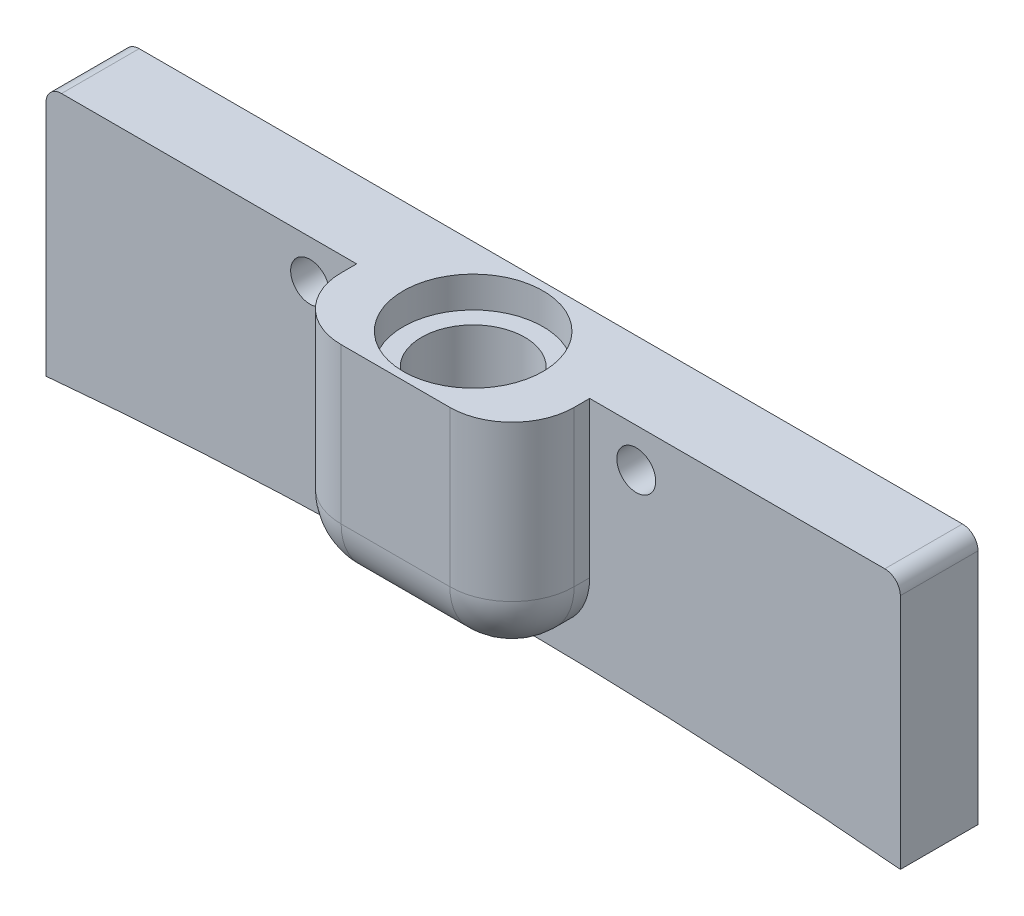
ISO-10303-21;
HEADER;
FILE_DESCRIPTION(('STEP AP214'),'2;1');
FILE_NAME('part.step','',(''),(''),'','','');
FILE_SCHEMA(('AUTOMOTIVE_DESIGN { 1 0 10303 214 1 1 1 1 }'));
ENDSEC;
DATA;
#1=APPLICATION_CONTEXT('core data for automotive mechanical design processes');
#2=APPLICATION_PROTOCOL_DEFINITION('international standard','automotive_design',2000,#1);
#3=PRODUCT_CONTEXT('',#1,'mechanical');
#4=PRODUCT('Part','Part','',(#3));
#5=PRODUCT_RELATED_PRODUCT_CATEGORY('part','',(#4));
#6=PRODUCT_DEFINITION_FORMATION('','',#4);
#7=PRODUCT_DEFINITION_CONTEXT('part definition',#1,'design');
#8=PRODUCT_DEFINITION('design','',#6,#7);
#9=PRODUCT_DEFINITION_SHAPE('','',#8);
#10=(LENGTH_UNIT() NAMED_UNIT(*) SI_UNIT(.MILLI.,.METRE.));
#11=(NAMED_UNIT(*) PLANE_ANGLE_UNIT() SI_UNIT($,.RADIAN.));
#12=(NAMED_UNIT(*) SI_UNIT($,.STERADIAN.) SOLID_ANGLE_UNIT());
#13=UNCERTAINTY_MEASURE_WITH_UNIT(LENGTH_MEASURE(1.E-05),#10,'distance_accuracy_value','');
#14=(GEOMETRIC_REPRESENTATION_CONTEXT(3) GLOBAL_UNCERTAINTY_ASSIGNED_CONTEXT((#13)) GLOBAL_UNIT_ASSIGNED_CONTEXT((#10,
#11,#12)) REPRESENTATION_CONTEXT('',''));
#15=CARTESIAN_POINT('',(0.,0.,0.));
#16=DIRECTION('',(0.,0.,1.));
#17=DIRECTION('',(1.,0.,0.));
#18=AXIS2_PLACEMENT_3D('',#15,#16,#17);
#19=CARTESIAN_POINT('',(-1.09287578986539E-12,-315.000000000012,5.));
#20=DIRECTION('',(0.,0.,-1.));
#21=DIRECTION('',(-1.,0.,0.));
#22=AXIS2_PLACEMENT_3D('',#19,#20,#21);
#23=CYLINDRICAL_SURFACE('',#22,299.999999999988);
#24=CARTESIAN_POINT('',(-1.09287578986539E-12,-315.000000000012,0.));
#25=DIRECTION('',(0.,0.,1.));
#26=DIRECTION('',(1.,0.,0.));
#27=AXIS2_PLACEMENT_3D('',#24,#25,#26);
#28=CIRCLE('',#27,299.999999999988);
#29=CARTESIAN_POINT('',(27.5,-16.263075599976,0.));
#30=VERTEX_POINT('',#29);
#31=CARTESIAN_POINT('',(-27.5000000737673,-16.2630756067663,0.));
#32=VERTEX_POINT('',#31);
#33=EDGE_CURVE('E212',#30,#32,#28,.T.);
#34=ORIENTED_EDGE('',*,*,#33,.F.);
#35=DIRECTION('',(0.,0.,-1.));
#36=VECTOR('',#35,1.);
#37=CARTESIAN_POINT('',(27.5,-16.263075599976,5.));
#38=LINE('',#37,#36);
#39=CARTESIAN_POINT('',(27.5,-16.263075599976,5.));
#40=VERTEX_POINT('',#39);
#41=EDGE_CURVE('E202',#40,#30,#38,.T.);
#42=ORIENTED_EDGE('',*,*,#41,.F.);
#43=CARTESIAN_POINT('',(-1.09287578986539E-12,-315.000000000012,5.));
#44=DIRECTION('',(0.,0.,1.));
#45=DIRECTION('',(1.,0.,0.));
#46=AXIS2_PLACEMENT_3D('',#43,#44,#45);
#47=CIRCLE('',#46,299.999999999988);
#48=CARTESIAN_POINT('',(-27.5000000737673,-16.2630756067663,5.));
#49=VERTEX_POINT('',#48);
#50=EDGE_CURVE('E165',#40,#49,#47,.T.);
#51=ORIENTED_EDGE('',*,*,#50,.T.);
#52=DIRECTION('',(0.,0.,-1.));
#53=VECTOR('',#52,1.);
#54=CARTESIAN_POINT('',(-27.5000000737673,-16.2630756067663,5.));
#55=LINE('',#54,#53);
#56=EDGE_CURVE('E199',#49,#32,#55,.T.);
#57=ORIENTED_EDGE('',*,*,#56,.T.);
#58=EDGE_LOOP('',(#34,#42,#51,#57));
#59=FACE_BOUND('',#58,.T.);
#60=ADVANCED_FACE('F32',(#59),#23,.F.);
#61=CARTESIAN_POINT('',(27.5,0.,5.));
#62=DIRECTION('',(1.,0.,0.));
#63=DIRECTION('',(0.,0.,-1.));
#64=AXIS2_PLACEMENT_3D('',#61,#62,#63);
#65=PLANE('',#64);
#66=DIRECTION('',(0.,-1.,0.));
#67=VECTOR('',#66,1.);
#68=CARTESIAN_POINT('',(27.5,0.,0.));
#69=LINE('',#68,#67);
#70=CARTESIAN_POINT('',(27.5,-1.,0.));
#71=VERTEX_POINT('',#70);
#72=EDGE_CURVE('E205',#71,#30,#69,.T.);
#73=ORIENTED_EDGE('',*,*,#72,.F.);
#74=DIRECTION('',(0.,0.,-1.));
#75=VECTOR('',#74,1.);
#76=CARTESIAN_POINT('',(27.5,-1.,5.));
#77=LINE('',#76,#75);
#78=CARTESIAN_POINT('',(27.5,-1.,5.));
#79=VERTEX_POINT('',#78);
#80=EDGE_CURVE('E290',#71,#79,#77,.F.);
#81=ORIENTED_EDGE('',*,*,#80,.T.);
#82=DIRECTION('',(0.,-1.,0.));
#83=VECTOR('',#82,1.);
#84=CARTESIAN_POINT('',(27.5,0.,5.));
#85=LINE('',#84,#83);
#86=EDGE_CURVE('E187',#79,#40,#85,.T.);
#87=ORIENTED_EDGE('',*,*,#86,.T.);
#88=ORIENTED_EDGE('',*,*,#41,.T.);
#89=EDGE_LOOP('',(#73,#81,#87,#88));
#90=FACE_BOUND('',#89,.T.);
#91=ADVANCED_FACE('F315',(#90),#65,.T.);
#92=CARTESIAN_POINT('',(-27.5000000737673,0.,5.));
#93=DIRECTION('',(0.,1.,0.));
#94=DIRECTION('',(-1.,0.,0.));
#95=AXIS2_PLACEMENT_3D('',#92,#93,#94);
#96=PLANE('',#95);
#97=CARTESIAN_POINT('',(0.,0.,5.));
#98=DIRECTION('',(0.,1.,0.));
#99=DIRECTION('',(0.,0.,1.));
#100=AXIS2_PLACEMENT_3D('',#97,#98,#99);
#101=CIRCLE('',#100,4.49999999999999);
#102=CARTESIAN_POINT('',(0.,0.,9.49999999999999));
#103=VERTEX_POINT('',#102);
#104=EDGE_CURVE('E248',#103,#103,#101,.T.);
#105=ORIENTED_EDGE('',*,*,#104,.F.);
#106=EDGE_LOOP('',(#105));
#107=FACE_BOUND('',#106,.T.);
#108=DIRECTION('',(-1.,0.,0.));
#109=VECTOR('',#108,1.);
#110=CARTESIAN_POINT('',(-7.5,0.,10.));
#111=LINE('',#110,#109);
#112=CARTESIAN_POINT('',(3.5,0.,10.));
#113=VERTEX_POINT('',#112);
#114=CARTESIAN_POINT('',(-3.5,0.,10.));
#115=VERTEX_POINT('',#114);
#116=EDGE_CURVE('E156',#113,#115,#111,.T.);
#117=ORIENTED_EDGE('',*,*,#116,.F.);
#118=CARTESIAN_POINT('',(3.5,0.,6.));
#119=DIRECTION('',(0.,1.,0.));
#120=DIRECTION('',(-1.,0.,0.));
#121=AXIS2_PLACEMENT_3D('',#118,#119,#120);
#122=CIRCLE('',#121,4.);
#123=CARTESIAN_POINT('',(7.5,0.,6.));
#124=VERTEX_POINT('',#123);
#125=EDGE_CURVE('E224',#113,#124,#122,.T.);
#126=ORIENTED_EDGE('',*,*,#125,.T.);
#127=DIRECTION('',(0.,0.,-1.));
#128=VECTOR('',#127,1.);
#129=CARTESIAN_POINT('',(7.5,0.,10.));
#130=LINE('',#129,#128);
#131=CARTESIAN_POINT('',(7.5,0.,5.));
#132=VERTEX_POINT('',#131);
#133=EDGE_CURVE('E159',#124,#132,#130,.T.);
#134=ORIENTED_EDGE('',*,*,#133,.T.);
#135=DIRECTION('',(1.,0.,0.));
#136=VECTOR('',#135,1.);
#137=CARTESIAN_POINT('',(-27.5000000737673,0.,5.));
#138=LINE('',#137,#136);
#139=CARTESIAN_POINT('',(26.5,0.,5.));
#140=VERTEX_POINT('',#139);
#141=EDGE_CURVE('E188',#132,#140,#138,.T.);
#142=ORIENTED_EDGE('',*,*,#141,.T.);
#143=DIRECTION('',(0.,0.,-1.));
#144=VECTOR('',#143,1.);
#145=CARTESIAN_POINT('',(26.5,0.,5.));
#146=LINE('',#145,#144);
#147=CARTESIAN_POINT('',(26.5,0.,0.));
#148=VERTEX_POINT('',#147);
#149=EDGE_CURVE('E292',#140,#148,#146,.T.);
#150=ORIENTED_EDGE('',*,*,#149,.T.);
#151=DIRECTION('',(1.,0.,0.));
#152=VECTOR('',#151,1.);
#153=CARTESIAN_POINT('',(-27.5000000737673,0.,0.));
#154=LINE('',#153,#152);
#155=CARTESIAN_POINT('',(-26.5000000737673,0.,0.));
#156=VERTEX_POINT('',#155);
#157=EDGE_CURVE('E207',#156,#148,#154,.T.);
#158=ORIENTED_EDGE('',*,*,#157,.F.);
#159=DIRECTION('',(0.,0.,-1.));
#160=VECTOR('',#159,1.);
#161=CARTESIAN_POINT('',(-26.5000000737673,0.,5.));
#162=LINE('',#161,#160);
#163=CARTESIAN_POINT('',(-26.5000000737673,0.,5.));
#164=VERTEX_POINT('',#163);
#165=EDGE_CURVE('E189',#156,#164,#162,.F.);
#166=ORIENTED_EDGE('',*,*,#165,.T.);
#167=CARTESIAN_POINT('',(-7.5,0.,5.));
#168=VERTEX_POINT('',#167);
#169=EDGE_CURVE('E183',#164,#168,#138,.T.);
#170=ORIENTED_EDGE('',*,*,#169,.T.);
#171=DIRECTION('',(0.,0.,-1.));
#172=VECTOR('',#171,1.);
#173=CARTESIAN_POINT('',(-7.5,0.,10.));
#174=LINE('',#173,#172);
#175=CARTESIAN_POINT('',(-7.5,0.,6.));
#176=VERTEX_POINT('',#175);
#177=EDGE_CURVE('E175',#176,#168,#174,.T.);
#178=ORIENTED_EDGE('',*,*,#177,.F.);
#179=CARTESIAN_POINT('',(-3.5,0.,6.));
#180=DIRECTION('',(0.,1.,0.));
#181=DIRECTION('',(-1.,0.,0.));
#182=AXIS2_PLACEMENT_3D('',#179,#180,#181);
#183=CIRCLE('',#182,4.);
#184=EDGE_CURVE('E222',#176,#115,#183,.T.);
#185=ORIENTED_EDGE('',*,*,#184,.T.);
#186=EDGE_LOOP('',(#117,#126,#134,#142,#150,#158,#166,#170,#178,#185));
#187=FACE_BOUND('',#186,.T.);
#188=ADVANCED_FACE('F306',(#107,#187),#96,.T.);
#189=CARTESIAN_POINT('',(-27.5000000737673,-16.2630756067663,5.));
#190=DIRECTION('',(-1.,0.,0.));
#191=DIRECTION('',(0.,0.,1.));
#192=AXIS2_PLACEMENT_3D('',#189,#190,#191);
#193=PLANE('',#192);
#194=DIRECTION('',(0.,1.,0.));
#195=VECTOR('',#194,1.);
#196=CARTESIAN_POINT('',(-27.5000000737673,-16.2630756067663,5.));
#197=LINE('',#196,#195);
#198=CARTESIAN_POINT('',(-27.5000000737673,-0.999999999999994,5.));
#199=VERTEX_POINT('',#198);
#200=EDGE_CURVE('E193',#49,#199,#197,.T.);
#201=ORIENTED_EDGE('',*,*,#200,.T.);
#202=DIRECTION('',(0.,0.,-1.));
#203=VECTOR('',#202,1.);
#204=CARTESIAN_POINT('',(-27.5000000737673,-0.999999999999994,5.));
#205=LINE('',#204,#203);
#206=CARTESIAN_POINT('',(-27.5000000737673,-0.999999999999994,0.));
#207=VERTEX_POINT('',#206);
#208=EDGE_CURVE('E171',#199,#207,#205,.T.);
#209=ORIENTED_EDGE('',*,*,#208,.T.);
#210=DIRECTION('',(0.,1.,0.));
#211=VECTOR('',#210,1.);
#212=CARTESIAN_POINT('',(-27.5000000737673,-16.2630756067663,0.));
#213=LINE('',#212,#211);
#214=EDGE_CURVE('E210',#32,#207,#213,.T.);
#215=ORIENTED_EDGE('',*,*,#214,.F.);
#216=ORIENTED_EDGE('',*,*,#56,.F.);
#217=EDGE_LOOP('',(#201,#209,#215,#216));
#218=FACE_BOUND('',#217,.T.);
#219=ADVANCED_FACE('F274',(#218),#193,.T.);
#220=CARTESIAN_POINT('',(-1.09287578986539E-12,-315.000000000012,5.));
#221=DIRECTION('',(0.,0.,1.));
#222=DIRECTION('',(1.,0.,0.));
#223=AXIS2_PLACEMENT_3D('',#220,#221,#222);
#224=PLANE('',#223);
#225=CARTESIAN_POINT('',(-10.5,-2.5,5.));
#226=DIRECTION('',(0.,0.,1.));
#227=DIRECTION('',(1.,0.,0.));
#228=AXIS2_PLACEMENT_3D('',#225,#226,#227);
#229=CIRCLE('',#228,1.24999999999999);
#230=CARTESIAN_POINT('',(-9.25000000000001,-2.5,5.));
#231=VERTEX_POINT('',#230);
#232=EDGE_CURVE('E264',#231,#231,#229,.T.);
#233=ORIENTED_EDGE('',*,*,#232,.F.);
#234=EDGE_LOOP('',(#233));
#235=FACE_BOUND('',#234,.T.);
#236=CARTESIAN_POINT('',(10.5,-2.5,5.));
#237=DIRECTION('',(0.,0.,1.));
#238=DIRECTION('',(1.,0.,0.));
#239=AXIS2_PLACEMENT_3D('',#236,#237,#238);
#240=CIRCLE('',#239,1.24999999999999);
#241=CARTESIAN_POINT('',(11.75,-2.5,5.));
#242=VERTEX_POINT('',#241);
#243=EDGE_CURVE('E258',#242,#242,#240,.T.);
#244=ORIENTED_EDGE('',*,*,#243,.F.);
#245=EDGE_LOOP('',(#244));
#246=FACE_BOUND('',#245,.T.);
#247=ORIENTED_EDGE('',*,*,#86,.F.);
#248=CARTESIAN_POINT('',(26.5,-1.,5.));
#249=DIRECTION('',(0.,0.,1.));
#250=DIRECTION('',(1.,0.,0.));
#251=AXIS2_PLACEMENT_3D('',#248,#249,#250);
#252=CIRCLE('',#251,1.);
#253=EDGE_CURVE('E281',#79,#140,#252,.T.);
#254=ORIENTED_EDGE('',*,*,#253,.T.);
#255=ORIENTED_EDGE('',*,*,#141,.F.);
#256=DIRECTION('',(0.,1.,0.));
#257=VECTOR('',#256,1.);
#258=CARTESIAN_POINT('',(7.5,0.,5.));
#259=LINE('',#258,#257);
#260=CARTESIAN_POINT('',(7.5,-10.,5.));
#261=VERTEX_POINT('',#260);
#262=EDGE_CURVE('E160',#261,#132,#259,.T.);
#263=ORIENTED_EDGE('',*,*,#262,.F.);
#264=CARTESIAN_POINT('',(3.5,-10.,5.));
#265=DIRECTION('',(0.,0.,1.));
#266=DIRECTION('',(1.,0.,0.));
#267=AXIS2_PLACEMENT_3D('',#264,#265,#266);
#268=CIRCLE('',#267,4.);
#269=CARTESIAN_POINT('',(3.5,-14.,5.));
#270=VERTEX_POINT('',#269);
#271=EDGE_CURVE('E41',#261,#270,#268,.F.);
#272=ORIENTED_EDGE('',*,*,#271,.T.);
#273=DIRECTION('',(1.,0.,0.));
#274=VECTOR('',#273,1.);
#275=CARTESIAN_POINT('',(7.5,-14.,5.));
#276=LINE('',#275,#274);
#277=CARTESIAN_POINT('',(-3.5,-14.,5.));
#278=VERTEX_POINT('',#277);
#279=EDGE_CURVE('E149',#278,#270,#276,.T.);
#280=ORIENTED_EDGE('',*,*,#279,.F.);
#281=CARTESIAN_POINT('',(-3.5,-10.,5.));
#282=DIRECTION('',(0.,0.,1.));
#283=DIRECTION('',(1.,0.,0.));
#284=AXIS2_PLACEMENT_3D('',#281,#282,#283);
#285=CIRCLE('',#284,4.);
#286=CARTESIAN_POINT('',(-7.5,-10.,5.));
#287=VERTEX_POINT('',#286);
#288=EDGE_CURVE('E11',#278,#287,#285,.F.);
#289=ORIENTED_EDGE('',*,*,#288,.T.);
#290=DIRECTION('',(0.,-1.,0.));
#291=VECTOR('',#290,1.);
#292=CARTESIAN_POINT('',(-7.5,-14.,5.));
#293=LINE('',#292,#291);
#294=EDGE_CURVE('E146',#168,#287,#293,.T.);
#295=ORIENTED_EDGE('',*,*,#294,.F.);
#296=ORIENTED_EDGE('',*,*,#169,.F.);
#297=CARTESIAN_POINT('',(-26.5000000737673,-0.999999999999994,5.));
#298=DIRECTION('',(0.,0.,1.));
#299=DIRECTION('',(1.,0.,0.));
#300=AXIS2_PLACEMENT_3D('',#297,#298,#299);
#301=CIRCLE('',#300,1.);
#302=EDGE_CURVE('E293',#164,#199,#301,.T.);
#303=ORIENTED_EDGE('',*,*,#302,.T.);
#304=ORIENTED_EDGE('',*,*,#200,.F.);
#305=ORIENTED_EDGE('',*,*,#50,.F.);
#306=EDGE_LOOP('',(#247,#254,#255,#263,#272,#280,#289,#295,#296,#303,#304,#305));
#307=FACE_BOUND('',#306,.T.);
#308=ADVANCED_FACE('F270',(#235,#246,#307),#224,.T.);
#309=CARTESIAN_POINT('',(-1.09287578986539E-12,-315.000000000012,0.));
#310=DIRECTION('',(0.,0.,1.));
#311=DIRECTION('',(1.,0.,0.));
#312=AXIS2_PLACEMENT_3D('',#309,#310,#311);
#313=PLANE('',#312);
#314=CARTESIAN_POINT('',(-10.5,-2.5,0.));
#315=DIRECTION('',(0.,0.,1.));
#316=DIRECTION('',(1.,0.,0.));
#317=AXIS2_PLACEMENT_3D('',#314,#315,#316);
#318=CIRCLE('',#317,1.25);
#319=CARTESIAN_POINT('',(-9.25,-2.5,0.));
#320=VERTEX_POINT('',#319);
#321=EDGE_CURVE('E261',#320,#320,#318,.T.);
#322=ORIENTED_EDGE('',*,*,#321,.T.);
#323=EDGE_LOOP('',(#322));
#324=FACE_BOUND('',#323,.T.);
#325=CARTESIAN_POINT('',(10.5,-2.5,0.));
#326=DIRECTION('',(0.,0.,1.));
#327=DIRECTION('',(1.,0.,0.));
#328=AXIS2_PLACEMENT_3D('',#325,#326,#327);
#329=CIRCLE('',#328,1.25);
#330=CARTESIAN_POINT('',(11.75,-2.5,0.));
#331=VERTEX_POINT('',#330);
#332=EDGE_CURVE('E234',#331,#331,#329,.T.);
#333=ORIENTED_EDGE('',*,*,#332,.T.);
#334=EDGE_LOOP('',(#333));
#335=FACE_BOUND('',#334,.T.);
#336=ORIENTED_EDGE('',*,*,#157,.T.);
#337=CARTESIAN_POINT('',(26.5,-1.,0.));
#338=DIRECTION('',(0.,0.,1.));
#339=DIRECTION('',(1.,0.,0.));
#340=AXIS2_PLACEMENT_3D('',#337,#338,#339);
#341=CIRCLE('',#340,1.);
#342=EDGE_CURVE('E298',#148,#71,#341,.F.);
#343=ORIENTED_EDGE('',*,*,#342,.T.);
#344=ORIENTED_EDGE('',*,*,#72,.T.);
#345=ORIENTED_EDGE('',*,*,#33,.T.);
#346=ORIENTED_EDGE('',*,*,#214,.T.);
#347=CARTESIAN_POINT('',(-26.5000000737673,-0.999999999999994,0.));
#348=DIRECTION('',(0.,0.,1.));
#349=DIRECTION('',(1.,0.,0.));
#350=AXIS2_PLACEMENT_3D('',#347,#348,#349);
#351=CIRCLE('',#350,1.);
#352=EDGE_CURVE('E300',#207,#156,#351,.F.);
#353=ORIENTED_EDGE('',*,*,#352,.T.);
#354=EDGE_LOOP('',(#336,#343,#344,#345,#346,#353));
#355=FACE_BOUND('',#354,.T.);
#356=ADVANCED_FACE('F273',(#324,#335,#355),#313,.F.);
#357=CARTESIAN_POINT('',(-7.5,-14.,10.));
#358=DIRECTION('',(1.,0.,0.));
#359=DIRECTION('',(0.,1.,0.));
#360=AXIS2_PLACEMENT_3D('',#357,#358,#359);
#361=PLANE('',#360);
#362=ORIENTED_EDGE('',*,*,#294,.T.);
#363=DIRECTION('',(0.,0.,-1.));
#364=VECTOR('',#363,1.);
#365=CARTESIAN_POINT('',(-7.5,-10.,10.));
#366=LINE('',#365,#364);
#367=CARTESIAN_POINT('',(-7.5,-10.,6.));
#368=VERTEX_POINT('',#367);
#369=EDGE_CURVE('E49',#287,#368,#366,.F.);
#370=ORIENTED_EDGE('',*,*,#369,.T.);
#371=DIRECTION('',(0.,-1.,0.));
#372=VECTOR('',#371,1.);
#373=CARTESIAN_POINT('',(-7.5,-14.,6.));
#374=LINE('',#373,#372);
#375=EDGE_CURVE('E226',#368,#176,#374,.F.);
#376=ORIENTED_EDGE('',*,*,#375,.T.);
#377=ORIENTED_EDGE('',*,*,#177,.T.);
#378=EDGE_LOOP('',(#362,#370,#376,#377));
#379=FACE_BOUND('',#378,.T.);
#380=ADVANCED_FACE('F389',(#379),#361,.F.);
#381=CARTESIAN_POINT('',(7.5,-14.,10.));
#382=DIRECTION('',(0.,1.,0.));
#383=DIRECTION('',(0.,0.,1.));
#384=AXIS2_PLACEMENT_3D('',#381,#382,#383);
#385=PLANE('',#384);
#386=ORIENTED_EDGE('',*,*,#279,.T.);
#387=DIRECTION('',(0.,0.,-1.));
#388=VECTOR('',#387,1.);
#389=CARTESIAN_POINT('',(3.5,-14.,10.));
#390=LINE('',#389,#388);
#391=CARTESIAN_POINT('',(3.5,-14.,6.));
#392=VERTEX_POINT('',#391);
#393=EDGE_CURVE('E367',#270,#392,#390,.F.);
#394=ORIENTED_EDGE('',*,*,#393,.T.);
#395=DIRECTION('',(1.,0.,0.));
#396=VECTOR('',#395,1.);
#397=CARTESIAN_POINT('',(7.5,-14.,6.));
#398=LINE('',#397,#396);
#399=CARTESIAN_POINT('',(-3.5,-14.,6.));
#400=VERTEX_POINT('',#399);
#401=EDGE_CURVE('E373',#392,#400,#398,.F.);
#402=ORIENTED_EDGE('',*,*,#401,.T.);
#403=DIRECTION('',(0.,0.,-1.));
#404=VECTOR('',#403,1.);
#405=CARTESIAN_POINT('',(-3.5,-14.,10.));
#406=LINE('',#405,#404);
#407=EDGE_CURVE('E371',#400,#278,#406,.T.);
#408=ORIENTED_EDGE('',*,*,#407,.T.);
#409=EDGE_LOOP('',(#386,#394,#402,#408));
#410=FACE_BOUND('',#409,.T.);
#411=ADVANCED_FACE('F385',(#410),#385,.F.);
#412=CARTESIAN_POINT('',(7.5,0.,10.));
#413=DIRECTION('',(-1.,0.,0.));
#414=DIRECTION('',(0.,0.,1.));
#415=AXIS2_PLACEMENT_3D('',#412,#413,#414);
#416=PLANE('',#415);
#417=DIRECTION('',(0.,1.,0.));
#418=VECTOR('',#417,1.);
#419=CARTESIAN_POINT('',(7.5,0.,6.));
#420=LINE('',#419,#418);
#421=CARTESIAN_POINT('',(7.5,-10.,6.));
#422=VERTEX_POINT('',#421);
#423=EDGE_CURVE('E176',#124,#422,#420,.F.);
#424=ORIENTED_EDGE('',*,*,#423,.T.);
#425=DIRECTION('',(0.,0.,-1.));
#426=VECTOR('',#425,1.);
#427=CARTESIAN_POINT('',(7.5,-10.,10.));
#428=LINE('',#427,#426);
#429=EDGE_CURVE('E374',#422,#261,#428,.T.);
#430=ORIENTED_EDGE('',*,*,#429,.T.);
#431=ORIENTED_EDGE('',*,*,#262,.T.);
#432=ORIENTED_EDGE('',*,*,#133,.F.);
#433=EDGE_LOOP('',(#424,#430,#431,#432));
#434=FACE_BOUND('',#433,.T.);
#435=ADVANCED_FACE('F381',(#434),#416,.F.);
#436=CARTESIAN_POINT('',(0.,0.,10.));
#437=DIRECTION('',(0.,0.,-1.));
#438=DIRECTION('',(-1.,0.,0.));
#439=AXIS2_PLACEMENT_3D('',#436,#437,#438);
#440=PLANE('',#439);
#441=DIRECTION('',(1.,0.,0.));
#442=VECTOR('',#441,1.);
#443=CARTESIAN_POINT('',(0.,-10.,10.));
#444=LINE('',#443,#442);
#445=CARTESIAN_POINT('',(-3.5,-10.,10.));
#446=VERTEX_POINT('',#445);
#447=CARTESIAN_POINT('',(3.5,-10.,10.));
#448=VERTEX_POINT('',#447);
#449=EDGE_CURVE('E364',#446,#448,#444,.T.);
#450=ORIENTED_EDGE('',*,*,#449,.T.);
#451=DIRECTION('',(0.,1.,0.));
#452=VECTOR('',#451,1.);
#453=CARTESIAN_POINT('',(3.5,0.,10.));
#454=LINE('',#453,#452);
#455=EDGE_CURVE('E220',#448,#113,#454,.T.);
#456=ORIENTED_EDGE('',*,*,#455,.T.);
#457=ORIENTED_EDGE('',*,*,#116,.T.);
#458=DIRECTION('',(0.,-1.,0.));
#459=VECTOR('',#458,1.);
#460=CARTESIAN_POINT('',(-3.5,0.,10.));
#461=LINE('',#460,#459);
#462=EDGE_CURVE('E359',#115,#446,#461,.T.);
#463=ORIENTED_EDGE('',*,*,#462,.T.);
#464=EDGE_LOOP('',(#450,#456,#457,#463));
#465=FACE_BOUND('',#464,.T.);
#466=ADVANCED_FACE('F140',(#465),#440,.F.);
#467=CARTESIAN_POINT('',(0.,-9.99999999999999,5.));
#468=DIRECTION('',(0.,1.,0.));
#469=DIRECTION('',(0.,0.,1.));
#470=AXIS2_PLACEMENT_3D('',#467,#468,#469);
#471=CONICAL_SURFACE('',#470,3.3235,1.0297442587514);
#472=CARTESIAN_POINT('',(0.,-11.996960267,5.));
#473=VERTEX_POINT('',#472);
#474=VERTEX_LOOP('',#473);
#475=FACE_BOUND('',#474,.T.);
#476=CARTESIAN_POINT('',(0.,-9.99999999999999,5.));
#477=DIRECTION('',(0.,1.,0.));
#478=DIRECTION('',(0.,0.,1.));
#479=AXIS2_PLACEMENT_3D('',#476,#477,#478);
#480=CIRCLE('',#479,3.3235);
#481=CARTESIAN_POINT('',(0.,-9.99999999999999,8.3235));
#482=VERTEX_POINT('',#481);
#483=EDGE_CURVE('E144',#482,#482,#480,.T.);
#484=ORIENTED_EDGE('',*,*,#483,.T.);
#485=EDGE_LOOP('',(#484));
#486=FACE_BOUND('',#485,.T.);
#487=ADVANCED_FACE('F136',(#475,#486),#471,.F.);
#488=CARTESIAN_POINT('',(0.,0.,5.));
#489=DIRECTION('',(0.,1.,0.));
#490=DIRECTION('',(0.,0.,1.));
#491=AXIS2_PLACEMENT_3D('',#488,#489,#490);
#492=CYLINDRICAL_SURFACE('',#491,3.3235);
#493=ORIENTED_EDGE('',*,*,#483,.F.);
#494=EDGE_LOOP('',(#493));
#495=FACE_BOUND('',#494,.T.);
#496=CARTESIAN_POINT('',(0.,-2.,5.));
#497=DIRECTION('',(0.,1.,0.));
#498=DIRECTION('',(0.,0.,1.));
#499=AXIS2_PLACEMENT_3D('',#496,#497,#498);
#500=CIRCLE('',#499,3.3235);
#501=CARTESIAN_POINT('',(0.,-2.,8.3235));
#502=VERTEX_POINT('',#501);
#503=EDGE_CURVE('E147',#502,#502,#500,.T.);
#504=ORIENTED_EDGE('',*,*,#503,.T.);
#505=EDGE_LOOP('',(#504));
#506=FACE_BOUND('',#505,.T.);
#507=ADVANCED_FACE('F139',(#495,#506),#492,.F.);
#508=CARTESIAN_POINT('',(3.3235,-2.,5.));
#509=DIRECTION('',(0.,-1.,0.));
#510=DIRECTION('',(0.,0.,-1.));
#511=AXIS2_PLACEMENT_3D('',#508,#509,#510);
#512=PLANE('',#511);
#513=ORIENTED_EDGE('',*,*,#503,.F.);
#514=EDGE_LOOP('',(#513));
#515=FACE_BOUND('',#514,.T.);
#516=CARTESIAN_POINT('',(0.,-2.,5.));
#517=DIRECTION('',(0.,1.,0.));
#518=DIRECTION('',(0.,0.,1.));
#519=AXIS2_PLACEMENT_3D('',#516,#517,#518);
#520=CIRCLE('',#519,4.49999999999999);
#521=CARTESIAN_POINT('',(0.,-2.,9.49999999999999));
#522=VERTEX_POINT('',#521);
#523=EDGE_CURVE('E152',#522,#522,#520,.T.);
#524=ORIENTED_EDGE('',*,*,#523,.T.);
#525=EDGE_LOOP('',(#524));
#526=FACE_BOUND('',#525,.T.);
#527=ADVANCED_FACE('F510',(#515,#526),#512,.F.);
#528=CARTESIAN_POINT('',(0.,0.,5.));
#529=DIRECTION('',(0.,1.,0.));
#530=DIRECTION('',(0.,0.,1.));
#531=AXIS2_PLACEMENT_3D('',#528,#529,#530);
#532=CYLINDRICAL_SURFACE('',#531,4.49999999999999);
#533=ORIENTED_EDGE('',*,*,#523,.F.);
#534=EDGE_LOOP('',(#533));
#535=FACE_BOUND('',#534,.T.);
#536=ORIENTED_EDGE('',*,*,#104,.T.);
#537=EDGE_LOOP('',(#536));
#538=FACE_BOUND('',#537,.T.);
#539=ADVANCED_FACE('F328',(#535,#538),#532,.F.);
#540=CARTESIAN_POINT('',(26.5,-1.,5.));
#541=DIRECTION('',(0.,0.,-1.));
#542=DIRECTION('',(-1.,0.,0.));
#543=AXIS2_PLACEMENT_3D('',#540,#541,#542);
#544=CYLINDRICAL_SURFACE('',#543,1.);
#545=ORIENTED_EDGE('',*,*,#253,.F.);
#546=ORIENTED_EDGE('',*,*,#80,.F.);
#547=ORIENTED_EDGE('',*,*,#342,.F.);
#548=ORIENTED_EDGE('',*,*,#149,.F.);
#549=EDGE_LOOP('',(#545,#546,#547,#548));
#550=FACE_BOUND('',#549,.T.);
#551=ADVANCED_FACE('F289',(#550),#544,.T.);
#552=CARTESIAN_POINT('',(-26.5000000737673,-0.999999999999994,5.));
#553=DIRECTION('',(0.,0.,-1.));
#554=DIRECTION('',(-1.,0.,0.));
#555=AXIS2_PLACEMENT_3D('',#552,#553,#554);
#556=CYLINDRICAL_SURFACE('',#555,1.);
#557=ORIENTED_EDGE('',*,*,#302,.F.);
#558=ORIENTED_EDGE('',*,*,#165,.F.);
#559=ORIENTED_EDGE('',*,*,#352,.F.);
#560=ORIENTED_EDGE('',*,*,#208,.F.);
#561=EDGE_LOOP('',(#557,#558,#559,#560));
#562=FACE_BOUND('',#561,.T.);
#563=ADVANCED_FACE('F311',(#562),#556,.T.);
#564=CARTESIAN_POINT('',(-3.5,-10.,10.));
#565=DIRECTION('',(0.,0.,-1.));
#566=DIRECTION('',(-1.,0.,0.));
#567=AXIS2_PLACEMENT_3D('',#564,#565,#566);
#568=CYLINDRICAL_SURFACE('',#567,4.);
#569=ORIENTED_EDGE('',*,*,#288,.F.);
#570=ORIENTED_EDGE('',*,*,#407,.F.);
#571=CARTESIAN_POINT('',(-3.5,-10.,6.));
#572=DIRECTION('',(0.,0.,1.));
#573=DIRECTION('',(1.,0.,0.));
#574=AXIS2_PLACEMENT_3D('',#571,#572,#573);
#575=CIRCLE('',#574,4.);
#576=EDGE_CURVE('E36',#368,#400,#575,.T.);
#577=ORIENTED_EDGE('',*,*,#576,.F.);
#578=ORIENTED_EDGE('',*,*,#369,.F.);
#579=EDGE_LOOP('',(#569,#570,#577,#578));
#580=FACE_BOUND('',#579,.T.);
#581=ADVANCED_FACE('F34',(#580),#568,.T.);
#582=CARTESIAN_POINT('',(-3.5,0.,6.));
#583=DIRECTION('',(0.,-1.,0.));
#584=DIRECTION('',(1.,0.,0.));
#585=AXIS2_PLACEMENT_3D('',#582,#583,#584);
#586=CYLINDRICAL_SURFACE('',#585,4.);
#587=ORIENTED_EDGE('',*,*,#184,.F.);
#588=ORIENTED_EDGE('',*,*,#375,.F.);
#589=CARTESIAN_POINT('',(-3.5,-10.,6.));
#590=DIRECTION('',(0.,-1.,0.));
#591=DIRECTION('',(0.,0.,-1.));
#592=AXIS2_PLACEMENT_3D('',#589,#590,#591);
#593=CIRCLE('',#592,4.);
#594=EDGE_CURVE('E242',#446,#368,#593,.T.);
#595=ORIENTED_EDGE('',*,*,#594,.F.);
#596=ORIENTED_EDGE('',*,*,#462,.F.);
#597=EDGE_LOOP('',(#587,#588,#595,#596));
#598=FACE_BOUND('',#597,.T.);
#599=ADVANCED_FACE('F350',(#598),#586,.T.);
#600=CARTESIAN_POINT('',(-3.5,-10.,6.));
#601=DIRECTION('',(0.,0.,1.));
#602=DIRECTION('',(1.,0.,0.));
#603=AXIS2_PLACEMENT_3D('',#600,#601,#602);
#604=SPHERICAL_SURFACE('',#603,4.);
#605=ORIENTED_EDGE('',*,*,#594,.T.);
#606=ORIENTED_EDGE('',*,*,#576,.T.);
#607=CARTESIAN_POINT('',(-3.5,-10.,6.));
#608=DIRECTION('',(-1.,0.,0.));
#609=DIRECTION('',(0.,0.,1.));
#610=AXIS2_PLACEMENT_3D('',#607,#608,#609);
#611=CIRCLE('',#610,4.);
#612=EDGE_CURVE('E240',#446,#400,#611,.F.);
#613=ORIENTED_EDGE('',*,*,#612,.F.);
#614=EDGE_LOOP('',(#605,#606,#613));
#615=FACE_BOUND('',#614,.T.);
#616=ADVANCED_FACE('F347',(#615),#604,.T.);
#617=CARTESIAN_POINT('',(0.,-10.,6.));
#618=DIRECTION('',(1.,0.,0.));
#619=DIRECTION('',(0.,0.,-1.));
#620=AXIS2_PLACEMENT_3D('',#617,#618,#619);
#621=CYLINDRICAL_SURFACE('',#620,4.);
#622=ORIENTED_EDGE('',*,*,#612,.T.);
#623=ORIENTED_EDGE('',*,*,#401,.F.);
#624=CARTESIAN_POINT('',(3.5,-10.,6.));
#625=DIRECTION('',(1.,0.,0.));
#626=DIRECTION('',(0.,0.,-1.));
#627=AXIS2_PLACEMENT_3D('',#624,#625,#626);
#628=CIRCLE('',#627,4.);
#629=EDGE_CURVE('E237',#448,#392,#628,.T.);
#630=ORIENTED_EDGE('',*,*,#629,.F.);
#631=ORIENTED_EDGE('',*,*,#449,.F.);
#632=EDGE_LOOP('',(#622,#623,#630,#631));
#633=FACE_BOUND('',#632,.T.);
#634=ADVANCED_FACE('F343',(#633),#621,.T.);
#635=CARTESIAN_POINT('',(3.5,0.,6.));
#636=DIRECTION('',(0.,1.,0.));
#637=DIRECTION('',(0.,0.,1.));
#638=AXIS2_PLACEMENT_3D('',#635,#636,#637);
#639=CYLINDRICAL_SURFACE('',#638,4.);
#640=ORIENTED_EDGE('',*,*,#125,.F.);
#641=ORIENTED_EDGE('',*,*,#455,.F.);
#642=CARTESIAN_POINT('',(3.5,-10.,6.));
#643=DIRECTION('',(0.,-1.,0.));
#644=DIRECTION('',(0.,0.,-1.));
#645=AXIS2_PLACEMENT_3D('',#642,#643,#644);
#646=CIRCLE('',#645,4.);
#647=EDGE_CURVE('E233',#422,#448,#646,.T.);
#648=ORIENTED_EDGE('',*,*,#647,.F.);
#649=ORIENTED_EDGE('',*,*,#423,.F.);
#650=EDGE_LOOP('',(#640,#641,#648,#649));
#651=FACE_BOUND('',#650,.T.);
#652=ADVANCED_FACE('F339',(#651),#639,.T.);
#653=CARTESIAN_POINT('',(3.5,-10.,6.));
#654=DIRECTION('',(0.,0.,1.));
#655=DIRECTION('',(1.,0.,0.));
#656=AXIS2_PLACEMENT_3D('',#653,#654,#655);
#657=SPHERICAL_SURFACE('',#656,4.);
#658=ORIENTED_EDGE('',*,*,#647,.T.);
#659=ORIENTED_EDGE('',*,*,#629,.T.);
#660=CARTESIAN_POINT('',(3.5,-10.,6.));
#661=DIRECTION('',(0.,0.,1.));
#662=DIRECTION('',(1.,0.,0.));
#663=AXIS2_PLACEMENT_3D('',#660,#661,#662);
#664=CIRCLE('',#663,4.);
#665=EDGE_CURVE('E230',#422,#392,#664,.F.);
#666=ORIENTED_EDGE('',*,*,#665,.F.);
#667=EDGE_LOOP('',(#658,#659,#666));
#668=FACE_BOUND('',#667,.T.);
#669=ADVANCED_FACE('F335',(#668),#657,.T.);
#670=CARTESIAN_POINT('',(3.5,-10.,10.));
#671=DIRECTION('',(0.,0.,-1.));
#672=DIRECTION('',(-1.,0.,0.));
#673=AXIS2_PLACEMENT_3D('',#670,#671,#672);
#674=CYLINDRICAL_SURFACE('',#673,4.);
#675=ORIENTED_EDGE('',*,*,#665,.T.);
#676=ORIENTED_EDGE('',*,*,#393,.F.);
#677=ORIENTED_EDGE('',*,*,#271,.F.);
#678=ORIENTED_EDGE('',*,*,#429,.F.);
#679=EDGE_LOOP('',(#675,#676,#677,#678));
#680=FACE_BOUND('',#679,.T.);
#681=ADVANCED_FACE('F331',(#680),#674,.T.);
#682=CARTESIAN_POINT('',(10.5,-2.5,5.));
#683=DIRECTION('',(0.,0.,1.));
#684=DIRECTION('',(1.,0.,0.));
#685=AXIS2_PLACEMENT_3D('',#682,#683,#684);
#686=CYLINDRICAL_SURFACE('',#685,1.24999999999999);
#687=ORIENTED_EDGE('',*,*,#332,.F.);
#688=EDGE_LOOP('',(#687));
#689=FACE_BOUND('',#688,.T.);
#690=ORIENTED_EDGE('',*,*,#243,.T.);
#691=EDGE_LOOP('',(#690));
#692=FACE_BOUND('',#691,.T.);
#693=ADVANCED_FACE('F334',(#689,#692),#686,.F.);
#694=CARTESIAN_POINT('',(-10.5,-2.5,5.));
#695=DIRECTION('',(0.,0.,1.));
#696=DIRECTION('',(1.,0.,0.));
#697=AXIS2_PLACEMENT_3D('',#694,#695,#696);
#698=CYLINDRICAL_SURFACE('',#697,1.24999999999999);
#699=ORIENTED_EDGE('',*,*,#321,.F.);
#700=EDGE_LOOP('',(#699));
#701=FACE_BOUND('',#700,.T.);
#702=ORIENTED_EDGE('',*,*,#232,.T.);
#703=EDGE_LOOP('',(#702));
#704=FACE_BOUND('',#703,.T.);
#705=ADVANCED_FACE('F268',(#701,#704),#698,.F.);
#706=CLOSED_SHELL('',(#60,#91,#188,#219,#308,#356,#380,#411,#435,#466,#487,#507,#527,#539,#551,
#563,#581,#599,#616,#634,#652,#669,#681,#693,#705));
#707=MANIFOLD_SOLID_BREP('B2',#706);
#708=ADVANCED_BREP_SHAPE_REPRESENTATION('',(#18,#707),#14);
#709=SHAPE_DEFINITION_REPRESENTATION(#9,#708);
ENDSEC;
END-ISO-10303-21;
